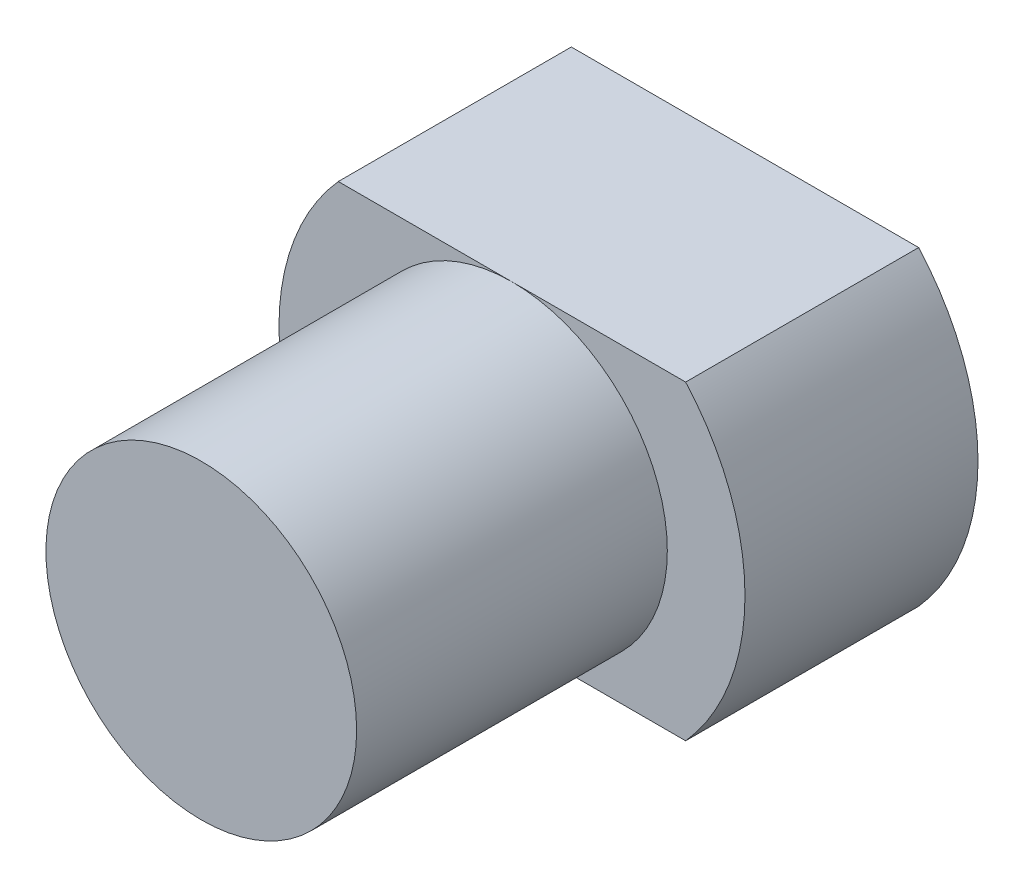
ISO-10303-21;
HEADER;
FILE_DESCRIPTION(('STEP AP214'),'2;1');
FILE_NAME('part.step','',(''),(''),'','','');
FILE_SCHEMA(('AUTOMOTIVE_DESIGN { 1 0 10303 214 1 1 1 1 }'));
ENDSEC;
DATA;
#1=APPLICATION_CONTEXT('core data for automotive mechanical design processes');
#2=APPLICATION_PROTOCOL_DEFINITION('international standard','automotive_design',2000,#1);
#3=PRODUCT_CONTEXT('',#1,'mechanical');
#4=PRODUCT('Part','Part','',(#3));
#5=PRODUCT_RELATED_PRODUCT_CATEGORY('part','',(#4));
#6=PRODUCT_DEFINITION_FORMATION('','',#4);
#7=PRODUCT_DEFINITION_CONTEXT('part definition',#1,'design');
#8=PRODUCT_DEFINITION('design','',#6,#7);
#9=PRODUCT_DEFINITION_SHAPE('','',#8);
#10=(LENGTH_UNIT() NAMED_UNIT(*) SI_UNIT(.MILLI.,.METRE.));
#11=(NAMED_UNIT(*) PLANE_ANGLE_UNIT() SI_UNIT($,.RADIAN.));
#12=(NAMED_UNIT(*) SI_UNIT($,.STERADIAN.) SOLID_ANGLE_UNIT());
#13=UNCERTAINTY_MEASURE_WITH_UNIT(LENGTH_MEASURE(1.E-05),#10,'distance_accuracy_value','');
#14=(GEOMETRIC_REPRESENTATION_CONTEXT(3) GLOBAL_UNCERTAINTY_ASSIGNED_CONTEXT((#13)) GLOBAL_UNIT_ASSIGNED_CONTEXT((#10,
#11,#12)) REPRESENTATION_CONTEXT('',''));
#15=CARTESIAN_POINT('',(0.,0.,0.));
#16=DIRECTION('',(0.,0.,1.));
#17=DIRECTION('',(1.,0.,0.));
#18=AXIS2_PLACEMENT_3D('',#15,#16,#17);
#19=CARTESIAN_POINT('',(0.,0.,19.05));
#20=DIRECTION('',(0.,0.,1.));
#21=DIRECTION('',(1.,0.,0.));
#22=AXIS2_PLACEMENT_3D('',#19,#20,#21);
#23=PLANE('',#22);
#24=CARTESIAN_POINT('',(0.,0.,19.05));
#25=DIRECTION('',(0.,0.,1.));
#26=DIRECTION('',(1.,0.,0.));
#27=AXIS2_PLACEMENT_3D('',#24,#25,#26);
#28=CIRCLE('',#27,12.7);
#29=CARTESIAN_POINT('',(0.,12.7,19.05));
#30=VERTEX_POINT('',#29);
#31=CARTESIAN_POINT('',(0.,-12.7,19.05));
#32=VERTEX_POINT('',#31);
#33=EDGE_CURVE('E41',#30,#32,#28,.T.);
#34=ORIENTED_EDGE('',*,*,#33,.F.);
#35=DIRECTION('',(-1.,0.,0.));
#36=VECTOR('',#35,1.);
#37=CARTESIAN_POINT('',(-14.1990316571237,12.7,19.05));
#38=LINE('',#37,#36);
#39=CARTESIAN_POINT('',(-14.1990316571237,12.7,19.05));
#40=VERTEX_POINT('',#39);
#41=EDGE_CURVE('E55',#30,#40,#38,.T.);
#42=ORIENTED_EDGE('',*,*,#41,.T.);
#43=CARTESIAN_POINT('',(0.,0.,19.05));
#44=DIRECTION('',(0.,0.,1.));
#45=DIRECTION('',(1.,0.,0.));
#46=AXIS2_PLACEMENT_3D('',#43,#44,#45);
#47=CIRCLE('',#46,19.05);
#48=CARTESIAN_POINT('',(-14.1990316571237,-12.7,19.05));
#49=VERTEX_POINT('',#48);
#50=EDGE_CURVE('E148',#40,#49,#47,.T.);
#51=ORIENTED_EDGE('',*,*,#50,.T.);
#52=DIRECTION('',(1.,0.,0.));
#53=VECTOR('',#52,1.);
#54=CARTESIAN_POINT('',(-14.1990316571237,-12.7,19.05));
#55=LINE('',#54,#53);
#56=EDGE_CURVE('E84',#49,#32,#55,.T.);
#57=ORIENTED_EDGE('',*,*,#56,.T.);
#58=EDGE_LOOP('',(#34,#42,#51,#57));
#59=FACE_BOUND('',#58,.T.);
#60=ADVANCED_FACE('F31',(#59),#23,.T.);
#61=CARTESIAN_POINT('',(0.,0.,19.05));
#62=DIRECTION('',(0.,0.,-1.));
#63=DIRECTION('',(-1.,0.,0.));
#64=AXIS2_PLACEMENT_3D('',#61,#62,#63);
#65=CYLINDRICAL_SURFACE('',#64,19.05);
#66=CARTESIAN_POINT('',(0.,0.,0.));
#67=DIRECTION('',(0.,0.,1.));
#68=DIRECTION('',(1.,0.,0.));
#69=AXIS2_PLACEMENT_3D('',#66,#67,#68);
#70=CIRCLE('',#69,19.05);
#71=CARTESIAN_POINT('',(-14.1990316571237,12.7,0.));
#72=VERTEX_POINT('',#71);
#73=CARTESIAN_POINT('',(-14.1990316571237,-12.7,0.));
#74=VERTEX_POINT('',#73);
#75=EDGE_CURVE('E144',#72,#74,#70,.T.);
#76=ORIENTED_EDGE('',*,*,#75,.T.);
#77=DIRECTION('',(0.,0.,-1.));
#78=VECTOR('',#77,1.);
#79=CARTESIAN_POINT('',(-14.1990316571237,-12.7,19.05));
#80=LINE('',#79,#78);
#81=EDGE_CURVE('E35',#49,#74,#80,.T.);
#82=ORIENTED_EDGE('',*,*,#81,.F.);
#83=ORIENTED_EDGE('',*,*,#50,.F.);
#84=DIRECTION('',(0.,0.,-1.));
#85=VECTOR('',#84,1.);
#86=CARTESIAN_POINT('',(-14.1990316571237,12.7,19.05));
#87=LINE('',#86,#85);
#88=EDGE_CURVE('E92',#40,#72,#87,.T.);
#89=ORIENTED_EDGE('',*,*,#88,.T.);
#90=EDGE_LOOP('',(#76,#82,#83,#89));
#91=FACE_BOUND('',#90,.T.);
#92=ADVANCED_FACE('F33',(#91),#65,.T.);
#93=CARTESIAN_POINT('',(-14.1990316571237,-12.7,19.05));
#94=DIRECTION('',(0.,1.,0.));
#95=DIRECTION('',(0.,0.,1.));
#96=AXIS2_PLACEMENT_3D('',#93,#94,#95);
#97=PLANE('',#96);
#98=DIRECTION('',(1.,0.,0.));
#99=VECTOR('',#98,1.);
#100=CARTESIAN_POINT('',(-14.1990316571237,-12.7,0.));
#101=LINE('',#100,#99);
#102=CARTESIAN_POINT('',(14.1990316571237,-12.7,0.));
#103=VERTEX_POINT('',#102);
#104=EDGE_CURVE('E136',#74,#103,#101,.T.);
#105=ORIENTED_EDGE('',*,*,#104,.T.);
#106=DIRECTION('',(0.,0.,-1.));
#107=VECTOR('',#106,1.);
#108=CARTESIAN_POINT('',(14.1990316571237,-12.7,19.05));
#109=LINE('',#108,#107);
#110=CARTESIAN_POINT('',(14.1990316571237,-12.7,19.05));
#111=VERTEX_POINT('',#110);
#112=EDGE_CURVE('E138',#111,#103,#109,.T.);
#113=ORIENTED_EDGE('',*,*,#112,.F.);
#114=EDGE_CURVE('E158',#32,#111,#55,.T.);
#115=ORIENTED_EDGE('',*,*,#114,.F.);
#116=ORIENTED_EDGE('',*,*,#56,.F.);
#117=ORIENTED_EDGE('',*,*,#81,.T.);
#118=EDGE_LOOP('',(#105,#113,#115,#116,#117));
#119=FACE_BOUND('',#118,.T.);
#120=ADVANCED_FACE('F119',(#119),#97,.F.);
#121=CARTESIAN_POINT('',(0.,0.,19.05));
#122=DIRECTION('',(0.,0.,-1.));
#123=DIRECTION('',(-1.,0.,0.));
#124=AXIS2_PLACEMENT_3D('',#121,#122,#123);
#125=CYLINDRICAL_SURFACE('',#124,19.05);
#126=CARTESIAN_POINT('',(0.,0.,0.));
#127=DIRECTION('',(0.,0.,1.));
#128=DIRECTION('',(1.,0.,0.));
#129=AXIS2_PLACEMENT_3D('',#126,#127,#128);
#130=CIRCLE('',#129,19.05);
#131=CARTESIAN_POINT('',(14.1990316571237,12.7,0.));
#132=VERTEX_POINT('',#131);
#133=EDGE_CURVE('E143',#103,#132,#130,.T.);
#134=ORIENTED_EDGE('',*,*,#133,.T.);
#135=DIRECTION('',(0.,0.,-1.));
#136=VECTOR('',#135,1.);
#137=CARTESIAN_POINT('',(14.1990316571237,12.7,19.05));
#138=LINE('',#137,#136);
#139=CARTESIAN_POINT('',(14.1990316571237,12.7,19.05));
#140=VERTEX_POINT('',#139);
#141=EDGE_CURVE('E146',#140,#132,#138,.T.);
#142=ORIENTED_EDGE('',*,*,#141,.F.);
#143=CARTESIAN_POINT('',(0.,0.,19.05));
#144=DIRECTION('',(0.,0.,1.));
#145=DIRECTION('',(1.,0.,0.));
#146=AXIS2_PLACEMENT_3D('',#143,#144,#145);
#147=CIRCLE('',#146,19.05);
#148=EDGE_CURVE('E90',#111,#140,#147,.T.);
#149=ORIENTED_EDGE('',*,*,#148,.F.);
#150=ORIENTED_EDGE('',*,*,#112,.T.);
#151=EDGE_LOOP('',(#134,#142,#149,#150));
#152=FACE_BOUND('',#151,.T.);
#153=ADVANCED_FACE('F125',(#152),#125,.T.);
#154=CARTESIAN_POINT('',(-14.1990316571237,12.7,19.05));
#155=DIRECTION('',(0.,-1.,0.));
#156=DIRECTION('',(0.,0.,-1.));
#157=AXIS2_PLACEMENT_3D('',#154,#155,#156);
#158=PLANE('',#157);
#159=DIRECTION('',(-1.,0.,0.));
#160=VECTOR('',#159,1.);
#161=CARTESIAN_POINT('',(-14.1990316571237,12.7,0.));
#162=LINE('',#161,#160);
#163=EDGE_CURVE('E77',#132,#72,#162,.T.);
#164=ORIENTED_EDGE('',*,*,#163,.T.);
#165=ORIENTED_EDGE('',*,*,#88,.F.);
#166=ORIENTED_EDGE('',*,*,#41,.F.);
#167=EDGE_CURVE('E87',#140,#30,#38,.T.);
#168=ORIENTED_EDGE('',*,*,#167,.F.);
#169=ORIENTED_EDGE('',*,*,#141,.T.);
#170=EDGE_LOOP('',(#164,#165,#166,#168,#169));
#171=FACE_BOUND('',#170,.T.);
#172=ADVANCED_FACE('F94',(#171),#158,.F.);
#173=EDGE_CURVE('E11',#32,#30,#28,.T.);
#174=ORIENTED_EDGE('',*,*,#173,.F.);
#175=ORIENTED_EDGE('',*,*,#114,.T.);
#176=ORIENTED_EDGE('',*,*,#148,.T.);
#177=ORIENTED_EDGE('',*,*,#167,.T.);
#178=EDGE_LOOP('',(#174,#175,#176,#177));
#179=FACE_BOUND('',#178,.T.);
#180=ADVANCED_FACE('F88',(#179),#23,.T.);
#181=CARTESIAN_POINT('',(0.,0.,0.));
#182=DIRECTION('',(0.,0.,1.));
#183=DIRECTION('',(1.,0.,0.));
#184=AXIS2_PLACEMENT_3D('',#181,#182,#183);
#185=PLANE('',#184);
#186=ORIENTED_EDGE('',*,*,#75,.F.);
#187=ORIENTED_EDGE('',*,*,#163,.F.);
#188=ORIENTED_EDGE('',*,*,#133,.F.);
#189=ORIENTED_EDGE('',*,*,#104,.F.);
#190=EDGE_LOOP('',(#186,#187,#188,#189));
#191=FACE_BOUND('',#190,.T.);
#192=ADVANCED_FACE('F102',(#191),#185,.F.);
#193=CARTESIAN_POINT('',(0.,0.,44.45));
#194=DIRECTION('',(0.,0.,-1.));
#195=DIRECTION('',(-1.,0.,0.));
#196=AXIS2_PLACEMENT_3D('',#193,#194,#195);
#197=CYLINDRICAL_SURFACE('',#196,12.7);
#198=CARTESIAN_POINT('',(0.,0.,44.45));
#199=DIRECTION('',(0.,0.,1.));
#200=DIRECTION('',(1.,0.,0.));
#201=AXIS2_PLACEMENT_3D('',#198,#199,#200);
#202=CIRCLE('',#201,12.7);
#203=CARTESIAN_POINT('',(12.7,0.,44.45));
#204=VERTEX_POINT('',#203);
#205=EDGE_CURVE('E98',#204,#204,#202,.T.);
#206=ORIENTED_EDGE('',*,*,#205,.F.);
#207=EDGE_LOOP('',(#206));
#208=FACE_BOUND('',#207,.T.);
#209=ORIENTED_EDGE('',*,*,#33,.T.);
#210=ORIENTED_EDGE('',*,*,#173,.T.);
#211=EDGE_LOOP('',(#209,#210));
#212=FACE_BOUND('',#211,.T.);
#213=ADVANCED_FACE('F99',(#208,#212),#197,.T.);
#214=CARTESIAN_POINT('',(0.,0.,44.45));
#215=DIRECTION('',(0.,0.,1.));
#216=DIRECTION('',(1.,0.,0.));
#217=AXIS2_PLACEMENT_3D('',#214,#215,#216);
#218=PLANE('',#217);
#219=ORIENTED_EDGE('',*,*,#205,.T.);
#220=EDGE_LOOP('',(#219));
#221=FACE_BOUND('',#220,.T.);
#222=ADVANCED_FACE('F101',(#221),#218,.T.);
#223=CLOSED_SHELL('',(#60,#92,#120,#153,#172,#180,#192,#213,#222));
#224=MANIFOLD_SOLID_BREP('B2',#223);
#225=ADVANCED_BREP_SHAPE_REPRESENTATION('',(#18,#224),#14);
#226=SHAPE_DEFINITION_REPRESENTATION(#9,#225);
ENDSEC;
END-ISO-10303-21;
